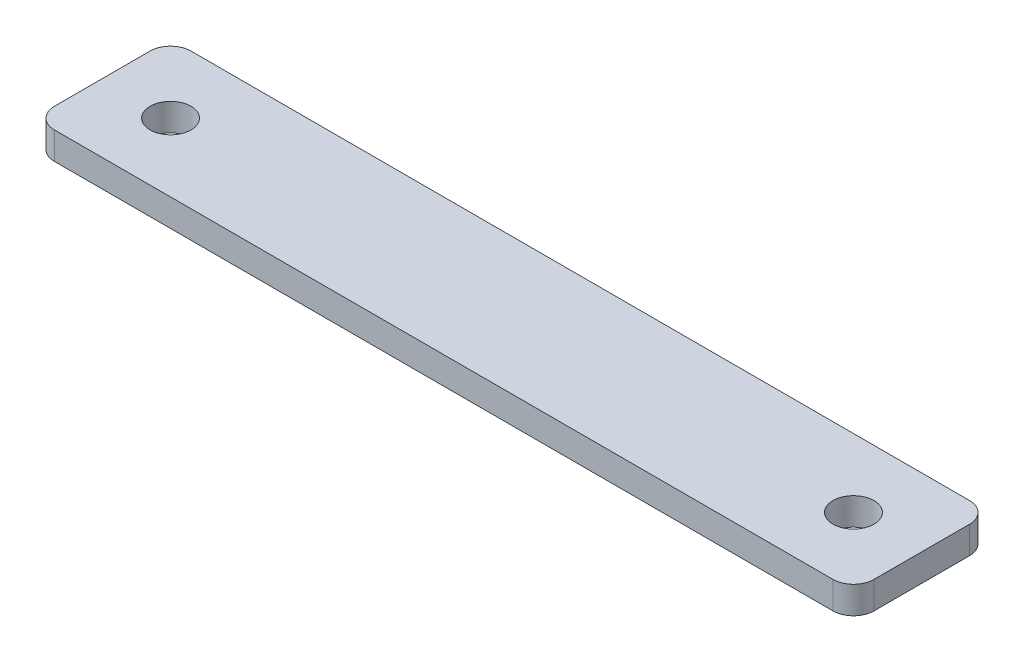
ISO-10303-21;
HEADER;
FILE_DESCRIPTION(('STEP AP214'),'2;1');
FILE_NAME('part.step','',(''),(''),'','','');
FILE_SCHEMA(('AUTOMOTIVE_DESIGN { 1 0 10303 214 1 1 1 1 }'));
ENDSEC;
DATA;
#1=APPLICATION_CONTEXT('core data for automotive mechanical design processes');
#2=APPLICATION_PROTOCOL_DEFINITION('international standard','automotive_design',2000,#1);
#3=PRODUCT_CONTEXT('',#1,'mechanical');
#4=PRODUCT('Part','Part','',(#3));
#5=PRODUCT_RELATED_PRODUCT_CATEGORY('part','',(#4));
#6=PRODUCT_DEFINITION_FORMATION('','',#4);
#7=PRODUCT_DEFINITION_CONTEXT('part definition',#1,'design');
#8=PRODUCT_DEFINITION('design','',#6,#7);
#9=PRODUCT_DEFINITION_SHAPE('','',#8);
#10=(LENGTH_UNIT() NAMED_UNIT(*) SI_UNIT(.MILLI.,.METRE.));
#11=(NAMED_UNIT(*) PLANE_ANGLE_UNIT() SI_UNIT($,.RADIAN.));
#12=(NAMED_UNIT(*) SI_UNIT($,.STERADIAN.) SOLID_ANGLE_UNIT());
#13=UNCERTAINTY_MEASURE_WITH_UNIT(LENGTH_MEASURE(1.E-05),#10,'distance_accuracy_value','');
#14=(GEOMETRIC_REPRESENTATION_CONTEXT(3) GLOBAL_UNCERTAINTY_ASSIGNED_CONTEXT((#13)) GLOBAL_UNIT_ASSIGNED_CONTEXT((#10,
#11,#12)) REPRESENTATION_CONTEXT('',''));
#15=CARTESIAN_POINT('',(0.,0.,0.));
#16=DIRECTION('',(0.,0.,1.));
#17=DIRECTION('',(1.,0.,0.));
#18=AXIS2_PLACEMENT_3D('',#15,#16,#17);
#19=CARTESIAN_POINT('',(60.,4.,10.));
#20=DIRECTION('',(-1.,0.,0.));
#21=DIRECTION('',(0.,0.,1.));
#22=AXIS2_PLACEMENT_3D('',#19,#20,#21);
#23=PLANE('',#22);
#24=DIRECTION('',(0.,0.,-1.));
#25=VECTOR('',#24,1.);
#26=CARTESIAN_POINT('',(60.,4.,10.));
#27=LINE('',#26,#25);
#28=CARTESIAN_POINT('',(60.,4.,7.));
#29=VERTEX_POINT('',#28);
#30=CARTESIAN_POINT('',(60.,4.,-7.));
#31=VERTEX_POINT('',#30);
#32=EDGE_CURVE('E126',#29,#31,#27,.T.);
#33=ORIENTED_EDGE('',*,*,#32,.F.);
#34=DIRECTION('',(0.,-1.,0.));
#35=VECTOR('',#34,1.);
#36=CARTESIAN_POINT('',(60.,4.,7.));
#37=LINE('',#36,#35);
#38=CARTESIAN_POINT('',(60.,0.,7.));
#39=VERTEX_POINT('',#38);
#40=EDGE_CURVE('E11',#29,#39,#37,.T.);
#41=ORIENTED_EDGE('',*,*,#40,.T.);
#42=DIRECTION('',(0.,0.,-1.));
#43=VECTOR('',#42,1.);
#44=CARTESIAN_POINT('',(60.,0.,10.));
#45=LINE('',#44,#43);
#46=CARTESIAN_POINT('',(60.,0.,-7.));
#47=VERTEX_POINT('',#46);
#48=EDGE_CURVE('E157',#39,#47,#45,.T.);
#49=ORIENTED_EDGE('',*,*,#48,.T.);
#50=DIRECTION('',(0.,-1.,0.));
#51=VECTOR('',#50,1.);
#52=CARTESIAN_POINT('',(60.,4.,-7.));
#53=LINE('',#52,#51);
#54=EDGE_CURVE('E40',#47,#31,#53,.F.);
#55=ORIENTED_EDGE('',*,*,#54,.T.);
#56=EDGE_LOOP('',(#33,#41,#49,#55));
#57=FACE_BOUND('',#56,.T.);
#58=ADVANCED_FACE('F32',(#57),#23,.F.);
#59=CARTESIAN_POINT('',(-60.,4.,-10.));
#60=DIRECTION('',(0.,0.,1.));
#61=DIRECTION('',(1.,0.,0.));
#62=AXIS2_PLACEMENT_3D('',#59,#60,#61);
#63=PLANE('',#62);
#64=DIRECTION('',(-1.,0.,0.));
#65=VECTOR('',#64,1.);
#66=CARTESIAN_POINT('',(-60.,0.,-10.));
#67=LINE('',#66,#65);
#68=CARTESIAN_POINT('',(57.,0.,-10.));
#69=VERTEX_POINT('',#68);
#70=CARTESIAN_POINT('',(-57.,0.,-10.));
#71=VERTEX_POINT('',#70);
#72=EDGE_CURVE('E131',#69,#71,#67,.T.);
#73=ORIENTED_EDGE('',*,*,#72,.T.);
#74=DIRECTION('',(0.,-1.,0.));
#75=VECTOR('',#74,1.);
#76=CARTESIAN_POINT('',(-57.,4.,-10.));
#77=LINE('',#76,#75);
#78=CARTESIAN_POINT('',(-57.,4.,-10.));
#79=VERTEX_POINT('',#78);
#80=EDGE_CURVE('E47',#71,#79,#77,.F.);
#81=ORIENTED_EDGE('',*,*,#80,.T.);
#82=DIRECTION('',(-1.,0.,0.));
#83=VECTOR('',#82,1.);
#84=CARTESIAN_POINT('',(-60.,4.,-10.));
#85=LINE('',#84,#83);
#86=CARTESIAN_POINT('',(57.,4.,-10.));
#87=VERTEX_POINT('',#86);
#88=EDGE_CURVE('E129',#87,#79,#85,.T.);
#89=ORIENTED_EDGE('',*,*,#88,.F.);
#90=DIRECTION('',(0.,-1.,0.));
#91=VECTOR('',#90,1.);
#92=CARTESIAN_POINT('',(57.,4.,-10.));
#93=LINE('',#92,#91);
#94=EDGE_CURVE('E149',#87,#69,#93,.T.);
#95=ORIENTED_EDGE('',*,*,#94,.T.);
#96=EDGE_LOOP('',(#73,#81,#89,#95));
#97=FACE_BOUND('',#96,.T.);
#98=ADVANCED_FACE('F164',(#97),#63,.F.);
#99=CARTESIAN_POINT('',(-60.,4.,10.));
#100=DIRECTION('',(1.,0.,0.));
#101=DIRECTION('',(0.,0.,-1.));
#102=AXIS2_PLACEMENT_3D('',#99,#100,#101);
#103=PLANE('',#102);
#104=DIRECTION('',(0.,0.,1.));
#105=VECTOR('',#104,1.);
#106=CARTESIAN_POINT('',(-60.,0.,10.));
#107=LINE('',#106,#105);
#108=CARTESIAN_POINT('',(-60.,0.,-7.));
#109=VERTEX_POINT('',#108);
#110=CARTESIAN_POINT('',(-60.,0.,7.));
#111=VERTEX_POINT('',#110);
#112=EDGE_CURVE('E127',#109,#111,#107,.T.);
#113=ORIENTED_EDGE('',*,*,#112,.T.);
#114=DIRECTION('',(0.,-1.,0.));
#115=VECTOR('',#114,1.);
#116=CARTESIAN_POINT('',(-60.,4.,7.));
#117=LINE('',#116,#115);
#118=CARTESIAN_POINT('',(-60.,4.,7.));
#119=VERTEX_POINT('',#118);
#120=EDGE_CURVE('E104',#111,#119,#117,.F.);
#121=ORIENTED_EDGE('',*,*,#120,.T.);
#122=DIRECTION('',(0.,0.,1.));
#123=VECTOR('',#122,1.);
#124=CARTESIAN_POINT('',(-60.,4.,10.));
#125=LINE('',#124,#123);
#126=CARTESIAN_POINT('',(-60.,4.,-7.));
#127=VERTEX_POINT('',#126);
#128=EDGE_CURVE('E169',#127,#119,#125,.T.);
#129=ORIENTED_EDGE('',*,*,#128,.F.);
#130=DIRECTION('',(0.,-1.,0.));
#131=VECTOR('',#130,1.);
#132=CARTESIAN_POINT('',(-60.,4.,-7.));
#133=LINE('',#132,#131);
#134=EDGE_CURVE('E109',#127,#109,#133,.T.);
#135=ORIENTED_EDGE('',*,*,#134,.T.);
#136=EDGE_LOOP('',(#113,#121,#129,#135));
#137=FACE_BOUND('',#136,.T.);
#138=ADVANCED_FACE('F211',(#137),#103,.F.);
#139=CARTESIAN_POINT('',(-60.,4.,10.));
#140=DIRECTION('',(0.,0.,-1.));
#141=DIRECTION('',(-1.,0.,0.));
#142=AXIS2_PLACEMENT_3D('',#139,#140,#141);
#143=PLANE('',#142);
#144=DIRECTION('',(1.,0.,0.));
#145=VECTOR('',#144,1.);
#146=CARTESIAN_POINT('',(-60.,4.,10.));
#147=LINE('',#146,#145);
#148=CARTESIAN_POINT('',(-57.,4.,10.));
#149=VERTEX_POINT('',#148);
#150=CARTESIAN_POINT('',(57.,4.,10.));
#151=VERTEX_POINT('',#150);
#152=EDGE_CURVE('E119',#149,#151,#147,.T.);
#153=ORIENTED_EDGE('',*,*,#152,.F.);
#154=DIRECTION('',(0.,-1.,0.));
#155=VECTOR('',#154,1.);
#156=CARTESIAN_POINT('',(-57.,4.,10.));
#157=LINE('',#156,#155);
#158=CARTESIAN_POINT('',(-57.,0.,10.));
#159=VERTEX_POINT('',#158);
#160=EDGE_CURVE('E103',#149,#159,#157,.T.);
#161=ORIENTED_EDGE('',*,*,#160,.T.);
#162=DIRECTION('',(1.,0.,0.));
#163=VECTOR('',#162,1.);
#164=CARTESIAN_POINT('',(-60.,0.,10.));
#165=LINE('',#164,#163);
#166=CARTESIAN_POINT('',(57.,0.,10.));
#167=VERTEX_POINT('',#166);
#168=EDGE_CURVE('E116',#159,#167,#165,.T.);
#169=ORIENTED_EDGE('',*,*,#168,.T.);
#170=DIRECTION('',(0.,-1.,0.));
#171=VECTOR('',#170,1.);
#172=CARTESIAN_POINT('',(57.,4.,10.));
#173=LINE('',#172,#171);
#174=EDGE_CURVE('E121',#167,#151,#173,.F.);
#175=ORIENTED_EDGE('',*,*,#174,.T.);
#176=EDGE_LOOP('',(#153,#161,#169,#175));
#177=FACE_BOUND('',#176,.T.);
#178=ADVANCED_FACE('F115',(#177),#143,.F.);
#179=CARTESIAN_POINT('',(0.,4.,0.));
#180=DIRECTION('',(0.,-1.,0.));
#181=DIRECTION('',(0.,0.,-1.));
#182=AXIS2_PLACEMENT_3D('',#179,#180,#181);
#183=PLANE('',#182);
#184=CARTESIAN_POINT('',(-50.,4.,0.));
#185=DIRECTION('',(0.,1.,0.));
#186=DIRECTION('',(0.,0.,1.));
#187=AXIS2_PLACEMENT_3D('',#184,#185,#186);
#188=CIRCLE('',#187,3.);
#189=CARTESIAN_POINT('',(-50.,4.,3.));
#190=VERTEX_POINT('',#189);
#191=EDGE_CURVE('E178',#190,#190,#188,.T.);
#192=ORIENTED_EDGE('',*,*,#191,.F.);
#193=EDGE_LOOP('',(#192));
#194=FACE_BOUND('',#193,.T.);
#195=CARTESIAN_POINT('',(50.,4.,-1.59594559789866E-13));
#196=DIRECTION('',(0.,1.,0.));
#197=DIRECTION('',(0.,0.,-1.));
#198=AXIS2_PLACEMENT_3D('',#195,#196,#197);
#199=CIRCLE('',#198,3.);
#200=CARTESIAN_POINT('',(50.,4.,-3.00000000000016));
#201=VERTEX_POINT('',#200);
#202=EDGE_CURVE('E172',#201,#201,#199,.T.);
#203=ORIENTED_EDGE('',*,*,#202,.F.);
#204=EDGE_LOOP('',(#203));
#205=FACE_BOUND('',#204,.T.);
#206=ORIENTED_EDGE('',*,*,#128,.T.);
#207=CARTESIAN_POINT('',(-57.,4.,7.));
#208=DIRECTION('',(0.,-1.,0.));
#209=DIRECTION('',(0.,0.,-1.));
#210=AXIS2_PLACEMENT_3D('',#207,#208,#209);
#211=CIRCLE('',#210,3.);
#212=EDGE_CURVE('E147',#119,#149,#211,.F.);
#213=ORIENTED_EDGE('',*,*,#212,.T.);
#214=ORIENTED_EDGE('',*,*,#152,.T.);
#215=CARTESIAN_POINT('',(57.,4.,7.));
#216=DIRECTION('',(0.,-1.,0.));
#217=DIRECTION('',(0.,0.,-1.));
#218=AXIS2_PLACEMENT_3D('',#215,#216,#217);
#219=CIRCLE('',#218,3.);
#220=EDGE_CURVE('E143',#151,#29,#219,.F.);
#221=ORIENTED_EDGE('',*,*,#220,.T.);
#222=ORIENTED_EDGE('',*,*,#32,.T.);
#223=CARTESIAN_POINT('',(57.,4.,-7.));
#224=DIRECTION('',(0.,-1.,0.));
#225=DIRECTION('',(0.,0.,-1.));
#226=AXIS2_PLACEMENT_3D('',#223,#224,#225);
#227=CIRCLE('',#226,3.);
#228=EDGE_CURVE('E54',#31,#87,#227,.F.);
#229=ORIENTED_EDGE('',*,*,#228,.T.);
#230=ORIENTED_EDGE('',*,*,#88,.T.);
#231=CARTESIAN_POINT('',(-57.,4.,-7.));
#232=DIRECTION('',(0.,-1.,0.));
#233=DIRECTION('',(0.,0.,-1.));
#234=AXIS2_PLACEMENT_3D('',#231,#232,#233);
#235=CIRCLE('',#234,3.);
#236=EDGE_CURVE('E145',#79,#127,#235,.F.);
#237=ORIENTED_EDGE('',*,*,#236,.T.);
#238=EDGE_LOOP('',(#206,#213,#214,#221,#222,#229,#230,#237));
#239=FACE_BOUND('',#238,.T.);
#240=ADVANCED_FACE('F160',(#194,#205,#239),#183,.F.);
#241=CARTESIAN_POINT('',(0.,0.,0.));
#242=DIRECTION('',(0.,-1.,0.));
#243=DIRECTION('',(0.,0.,-1.));
#244=AXIS2_PLACEMENT_3D('',#241,#242,#243);
#245=PLANE('',#244);
#246=CARTESIAN_POINT('',(-50.,0.,0.));
#247=DIRECTION('',(0.,1.,0.));
#248=DIRECTION('',(0.,0.,1.));
#249=AXIS2_PLACEMENT_3D('',#246,#247,#248);
#250=CIRCLE('',#249,3.);
#251=CARTESIAN_POINT('',(-50.,0.,3.));
#252=VERTEX_POINT('',#251);
#253=EDGE_CURVE('E165',#252,#252,#250,.T.);
#254=ORIENTED_EDGE('',*,*,#253,.T.);
#255=EDGE_LOOP('',(#254));
#256=FACE_BOUND('',#255,.T.);
#257=CARTESIAN_POINT('',(50.,0.,-1.59594559789866E-13));
#258=DIRECTION('',(0.,1.,0.));
#259=DIRECTION('',(0.,0.,-1.));
#260=AXIS2_PLACEMENT_3D('',#257,#258,#259);
#261=CIRCLE('',#260,3.);
#262=CARTESIAN_POINT('',(50.,0.,-3.00000000000016));
#263=VERTEX_POINT('',#262);
#264=EDGE_CURVE('E175',#263,#263,#261,.T.);
#265=ORIENTED_EDGE('',*,*,#264,.T.);
#266=EDGE_LOOP('',(#265));
#267=FACE_BOUND('',#266,.T.);
#268=ORIENTED_EDGE('',*,*,#168,.F.);
#269=CARTESIAN_POINT('',(-57.,0.,7.));
#270=DIRECTION('',(0.,-1.,0.));
#271=DIRECTION('',(0.,0.,-1.));
#272=AXIS2_PLACEMENT_3D('',#269,#270,#271);
#273=CIRCLE('',#272,3.);
#274=EDGE_CURVE('E99',#159,#111,#273,.T.);
#275=ORIENTED_EDGE('',*,*,#274,.T.);
#276=ORIENTED_EDGE('',*,*,#112,.F.);
#277=CARTESIAN_POINT('',(-57.,0.,-7.));
#278=DIRECTION('',(0.,-1.,0.));
#279=DIRECTION('',(0.,0.,-1.));
#280=AXIS2_PLACEMENT_3D('',#277,#278,#279);
#281=CIRCLE('',#280,3.);
#282=EDGE_CURVE('E110',#109,#71,#281,.T.);
#283=ORIENTED_EDGE('',*,*,#282,.T.);
#284=ORIENTED_EDGE('',*,*,#72,.F.);
#285=CARTESIAN_POINT('',(57.,0.,-7.));
#286=DIRECTION('',(0.,-1.,0.));
#287=DIRECTION('',(0.,0.,-1.));
#288=AXIS2_PLACEMENT_3D('',#285,#286,#287);
#289=CIRCLE('',#288,3.);
#290=EDGE_CURVE('E120',#69,#47,#289,.T.);
#291=ORIENTED_EDGE('',*,*,#290,.T.);
#292=ORIENTED_EDGE('',*,*,#48,.F.);
#293=CARTESIAN_POINT('',(57.,0.,7.));
#294=DIRECTION('',(0.,-1.,0.));
#295=DIRECTION('',(0.,0.,-1.));
#296=AXIS2_PLACEMENT_3D('',#293,#294,#295);
#297=CIRCLE('',#296,3.);
#298=EDGE_CURVE('E125',#39,#167,#297,.T.);
#299=ORIENTED_EDGE('',*,*,#298,.T.);
#300=EDGE_LOOP('',(#268,#275,#276,#283,#284,#291,#292,#299));
#301=FACE_BOUND('',#300,.T.);
#302=ADVANCED_FACE('F123',(#256,#267,#301),#245,.T.);
#303=CARTESIAN_POINT('',(50.,0.,-1.59594559789866E-13));
#304=DIRECTION('',(0.,1.,0.));
#305=DIRECTION('',(0.,0.,1.));
#306=AXIS2_PLACEMENT_3D('',#303,#304,#305);
#307=CYLINDRICAL_SURFACE('',#306,3.);
#308=ORIENTED_EDGE('',*,*,#264,.F.);
#309=EDGE_LOOP('',(#308));
#310=FACE_BOUND('',#309,.T.);
#311=ORIENTED_EDGE('',*,*,#202,.T.);
#312=EDGE_LOOP('',(#311));
#313=FACE_BOUND('',#312,.T.);
#314=ADVANCED_FACE('F189',(#310,#313),#307,.F.);
#315=CARTESIAN_POINT('',(-50.,0.,0.));
#316=DIRECTION('',(0.,1.,0.));
#317=DIRECTION('',(0.,0.,1.));
#318=AXIS2_PLACEMENT_3D('',#315,#316,#317);
#319=CYLINDRICAL_SURFACE('',#318,3.);
#320=ORIENTED_EDGE('',*,*,#253,.F.);
#321=EDGE_LOOP('',(#320));
#322=FACE_BOUND('',#321,.T.);
#323=ORIENTED_EDGE('',*,*,#191,.T.);
#324=EDGE_LOOP('',(#323));
#325=FACE_BOUND('',#324,.T.);
#326=ADVANCED_FACE('F186',(#322,#325),#319,.F.);
#327=CARTESIAN_POINT('',(-57.,4.,7.));
#328=DIRECTION('',(0.,-1.,0.));
#329=DIRECTION('',(0.,0.,-1.));
#330=AXIS2_PLACEMENT_3D('',#327,#328,#329);
#331=CYLINDRICAL_SURFACE('',#330,3.);
#332=ORIENTED_EDGE('',*,*,#212,.F.);
#333=ORIENTED_EDGE('',*,*,#120,.F.);
#334=ORIENTED_EDGE('',*,*,#274,.F.);
#335=ORIENTED_EDGE('',*,*,#160,.F.);
#336=EDGE_LOOP('',(#332,#333,#334,#335));
#337=FACE_BOUND('',#336,.T.);
#338=ADVANCED_FACE('F102',(#337),#331,.T.);
#339=CARTESIAN_POINT('',(-57.,4.,-7.));
#340=DIRECTION('',(0.,-1.,0.));
#341=DIRECTION('',(0.,0.,-1.));
#342=AXIS2_PLACEMENT_3D('',#339,#340,#341);
#343=CYLINDRICAL_SURFACE('',#342,3.);
#344=ORIENTED_EDGE('',*,*,#236,.F.);
#345=ORIENTED_EDGE('',*,*,#80,.F.);
#346=ORIENTED_EDGE('',*,*,#282,.F.);
#347=ORIENTED_EDGE('',*,*,#134,.F.);
#348=EDGE_LOOP('',(#344,#345,#346,#347));
#349=FACE_BOUND('',#348,.T.);
#350=ADVANCED_FACE('F217',(#349),#343,.T.);
#351=CARTESIAN_POINT('',(57.,4.,7.));
#352=DIRECTION('',(0.,-1.,0.));
#353=DIRECTION('',(0.,0.,-1.));
#354=AXIS2_PLACEMENT_3D('',#351,#352,#353);
#355=CYLINDRICAL_SURFACE('',#354,3.);
#356=ORIENTED_EDGE('',*,*,#220,.F.);
#357=ORIENTED_EDGE('',*,*,#174,.F.);
#358=ORIENTED_EDGE('',*,*,#298,.F.);
#359=ORIENTED_EDGE('',*,*,#40,.F.);
#360=EDGE_LOOP('',(#356,#357,#358,#359));
#361=FACE_BOUND('',#360,.T.);
#362=ADVANCED_FACE('F219',(#361),#355,.T.);
#363=CARTESIAN_POINT('',(57.,4.,-7.));
#364=DIRECTION('',(0.,-1.,0.));
#365=DIRECTION('',(0.,0.,-1.));
#366=AXIS2_PLACEMENT_3D('',#363,#364,#365);
#367=CYLINDRICAL_SURFACE('',#366,3.);
#368=ORIENTED_EDGE('',*,*,#228,.F.);
#369=ORIENTED_EDGE('',*,*,#54,.F.);
#370=ORIENTED_EDGE('',*,*,#290,.F.);
#371=ORIENTED_EDGE('',*,*,#94,.F.);
#372=EDGE_LOOP('',(#368,#369,#370,#371));
#373=FACE_BOUND('',#372,.T.);
#374=ADVANCED_FACE('F34',(#373),#367,.T.);
#375=CLOSED_SHELL('',(#58,#98,#138,#178,#240,#302,#314,#326,#338,#350,#362,#374));
#376=MANIFOLD_SOLID_BREP('B2',#375);
#377=ADVANCED_BREP_SHAPE_REPRESENTATION('',(#18,#376),#14);
#378=SHAPE_DEFINITION_REPRESENTATION(#9,#377);
ENDSEC;
END-ISO-10303-21;
